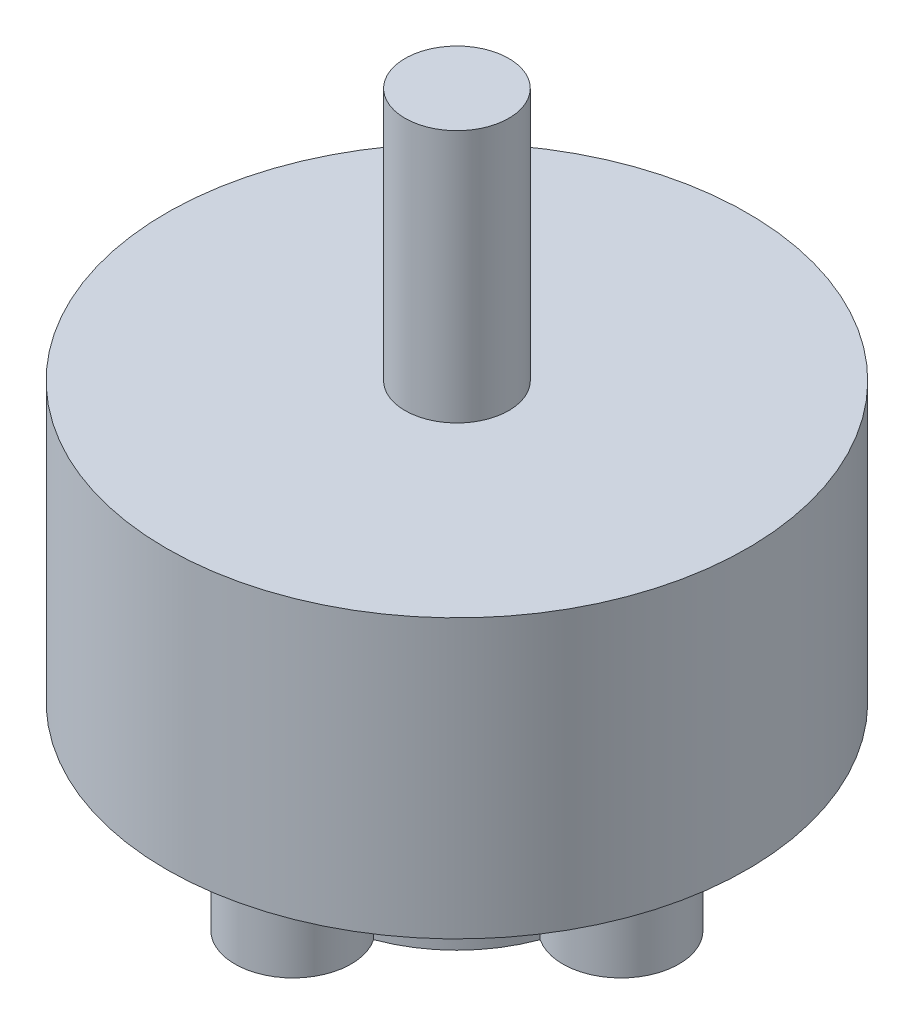
ISO-10303-21;
HEADER;
FILE_DESCRIPTION(('STEP AP214'),'2;1');
FILE_NAME('part.step','',(''),(''),'','','');
FILE_SCHEMA(('AUTOMOTIVE_DESIGN { 1 0 10303 214 1 1 1 1 }'));
ENDSEC;
DATA;
#1=APPLICATION_CONTEXT('core data for automotive mechanical design processes');
#2=APPLICATION_PROTOCOL_DEFINITION('international standard','automotive_design',2000,#1);
#3=PRODUCT_CONTEXT('',#1,'mechanical');
#4=PRODUCT('Part','Part','',(#3));
#5=PRODUCT_RELATED_PRODUCT_CATEGORY('part','',(#4));
#6=PRODUCT_DEFINITION_FORMATION('','',#4);
#7=PRODUCT_DEFINITION_CONTEXT('part definition',#1,'design');
#8=PRODUCT_DEFINITION('design','',#6,#7);
#9=PRODUCT_DEFINITION_SHAPE('','',#8);
#10=(LENGTH_UNIT() NAMED_UNIT(*) SI_UNIT(.MILLI.,.METRE.));
#11=(NAMED_UNIT(*) PLANE_ANGLE_UNIT() SI_UNIT($,.RADIAN.));
#12=(NAMED_UNIT(*) SI_UNIT($,.STERADIAN.) SOLID_ANGLE_UNIT());
#13=UNCERTAINTY_MEASURE_WITH_UNIT(LENGTH_MEASURE(1.E-05),#10,'distance_accuracy_value','');
#14=(GEOMETRIC_REPRESENTATION_CONTEXT(3) GLOBAL_UNCERTAINTY_ASSIGNED_CONTEXT((#13)) GLOBAL_UNIT_ASSIGNED_CONTEXT((#10,
#11,#12)) REPRESENTATION_CONTEXT('',''));
#15=CARTESIAN_POINT('',(0.,0.,0.));
#16=DIRECTION('',(0.,0.,1.));
#17=DIRECTION('',(1.,0.,0.));
#18=AXIS2_PLACEMENT_3D('',#15,#16,#17);
#19=CARTESIAN_POINT('',(0.,0.,0.));
#20=DIRECTION('',(0.,1.,0.));
#21=DIRECTION('',(0.,0.,1.));
#22=AXIS2_PLACEMENT_3D('',#19,#20,#21);
#23=PLANE('',#22);
#24=CARTESIAN_POINT('',(0.,0.,-7.9));
#25=DIRECTION('',(0.,-1.,0.));
#26=DIRECTION('',(0.,0.,-1.));
#27=AXIS2_PLACEMENT_3D('',#24,#25,#26);
#28=CIRCLE('',#27,2.8);
#29=CARTESIAN_POINT('',(-2.323487411199,0.,-6.33749999999998));
#30=VERTEX_POINT('',#29);
#31=CARTESIAN_POINT('',(2.32348741119891,0.,-6.33750000000002));
#32=VERTEX_POINT('',#31);
#33=EDGE_CURVE('E62',#30,#32,#28,.T.);
#34=ORIENTED_EDGE('',*,*,#33,.F.);
#35=CARTESIAN_POINT('',(0.,0.,0.));
#36=DIRECTION('',(0.,-1.,0.));
#37=DIRECTION('',(0.,0.,-1.));
#38=AXIS2_PLACEMENT_3D('',#35,#36,#37);
#39=CIRCLE('',#38,6.75);
#40=CARTESIAN_POINT('',(-6.33750000000002,0.,-2.32348741119888));
#41=VERTEX_POINT('',#40);
#42=EDGE_CURVE('E66',#41,#30,#39,.T.);
#43=ORIENTED_EDGE('',*,*,#42,.F.);
#44=CARTESIAN_POINT('',(-7.9,0.,0.));
#45=DIRECTION('',(0.,-1.,0.));
#46=DIRECTION('',(0.,0.,-1.));
#47=AXIS2_PLACEMENT_3D('',#44,#45,#46);
#48=CIRCLE('',#47,2.8);
#49=CARTESIAN_POINT('',(-6.33749999999998,0.,2.32348741119902));
#50=VERTEX_POINT('',#49);
#51=EDGE_CURVE('E304',#50,#41,#48,.T.);
#52=ORIENTED_EDGE('',*,*,#51,.F.);
#53=CARTESIAN_POINT('',(-2.32348741119895,0.,6.3375));
#54=VERTEX_POINT('',#53);
#55=EDGE_CURVE('E299',#54,#50,#39,.T.);
#56=ORIENTED_EDGE('',*,*,#55,.F.);
#57=CARTESIAN_POINT('',(0.,0.,7.9));
#58=DIRECTION('',(0.,-1.,0.));
#59=DIRECTION('',(0.,0.,-1.));
#60=AXIS2_PLACEMENT_3D('',#57,#58,#59);
#61=CIRCLE('',#60,2.8);
#62=CARTESIAN_POINT('',(2.32348741119895,0.,6.3375));
#63=VERTEX_POINT('',#62);
#64=EDGE_CURVE('E298',#63,#54,#61,.T.);
#65=ORIENTED_EDGE('',*,*,#64,.F.);
#66=CARTESIAN_POINT('',(6.33750000000001,0.,2.32348741119893));
#67=VERTEX_POINT('',#66);
#68=EDGE_CURVE('E291',#67,#63,#39,.T.);
#69=ORIENTED_EDGE('',*,*,#68,.F.);
#70=CARTESIAN_POINT('',(7.9,0.,0.));
#71=DIRECTION('',(0.,-1.,0.));
#72=DIRECTION('',(0.,0.,-1.));
#73=AXIS2_PLACEMENT_3D('',#70,#71,#72);
#74=CIRCLE('',#73,2.8);
#75=CARTESIAN_POINT('',(6.33749999999999,0.,-2.32348741119897));
#76=VERTEX_POINT('',#75);
#77=EDGE_CURVE('E295',#76,#67,#74,.T.);
#78=ORIENTED_EDGE('',*,*,#77,.F.);
#79=EDGE_CURVE('E296',#32,#76,#39,.T.);
#80=ORIENTED_EDGE('',*,*,#79,.F.);
#81=EDGE_LOOP('',(#34,#43,#52,#56,#65,#69,#78,#80));
#82=FACE_BOUND('',#81,.T.);
#83=CARTESIAN_POINT('',(0.,0.,0.));
#84=DIRECTION('',(0.,1.,0.));
#85=DIRECTION('',(0.,0.,1.));
#86=AXIS2_PLACEMENT_3D('',#83,#84,#85);
#87=CIRCLE('',#86,14.);
#88=CARTESIAN_POINT('',(0.,0.,14.));
#89=VERTEX_POINT('',#88);
#90=EDGE_CURVE('E49',#89,#89,#87,.T.);
#91=ORIENTED_EDGE('',*,*,#90,.F.);
#92=EDGE_LOOP('',(#91));
#93=FACE_BOUND('',#92,.T.);
#94=ADVANCED_FACE('F45',(#82,#93),#23,.F.);
#95=CARTESIAN_POINT('',(0.,13.4,0.));
#96=DIRECTION('',(0.,-1.,0.));
#97=DIRECTION('',(0.,0.,-1.));
#98=AXIS2_PLACEMENT_3D('',#95,#96,#97);
#99=CYLINDRICAL_SURFACE('',#98,14.);
#100=CARTESIAN_POINT('',(0.,13.4,0.));
#101=DIRECTION('',(0.,1.,0.));
#102=DIRECTION('',(0.,0.,1.));
#103=AXIS2_PLACEMENT_3D('',#100,#101,#102);
#104=CIRCLE('',#103,14.);
#105=CARTESIAN_POINT('',(0.,13.4,14.));
#106=VERTEX_POINT('',#105);
#107=EDGE_CURVE('E54',#106,#106,#104,.T.);
#108=ORIENTED_EDGE('',*,*,#107,.F.);
#109=EDGE_LOOP('',(#108));
#110=FACE_BOUND('',#109,.T.);
#111=ORIENTED_EDGE('',*,*,#90,.T.);
#112=EDGE_LOOP('',(#111));
#113=FACE_BOUND('',#112,.T.);
#114=ADVANCED_FACE('F47',(#110,#113),#99,.T.);
#115=CARTESIAN_POINT('',(0.,13.4,0.));
#116=DIRECTION('',(0.,1.,0.));
#117=DIRECTION('',(0.,0.,1.));
#118=AXIS2_PLACEMENT_3D('',#115,#116,#117);
#119=PLANE('',#118);
#120=CARTESIAN_POINT('',(0.,13.4,0.));
#121=DIRECTION('',(0.,1.,0.));
#122=DIRECTION('',(0.,0.,1.));
#123=AXIS2_PLACEMENT_3D('',#120,#121,#122);
#124=CIRCLE('',#123,2.5);
#125=CARTESIAN_POINT('',(0.,13.4,2.5));
#126=VERTEX_POINT('',#125);
#127=EDGE_CURVE('E11',#126,#126,#124,.T.);
#128=ORIENTED_EDGE('',*,*,#127,.F.);
#129=EDGE_LOOP('',(#128));
#130=FACE_BOUND('',#129,.T.);
#131=ORIENTED_EDGE('',*,*,#107,.T.);
#132=EDGE_LOOP('',(#131));
#133=FACE_BOUND('',#132,.T.);
#134=ADVANCED_FACE('F211',(#130,#133),#119,.T.);
#135=CARTESIAN_POINT('',(0.,25.6,0.));
#136=DIRECTION('',(0.,-1.,0.));
#137=DIRECTION('',(0.,0.,-1.));
#138=AXIS2_PLACEMENT_3D('',#135,#136,#137);
#139=CYLINDRICAL_SURFACE('',#138,2.5);
#140=CARTESIAN_POINT('',(0.,25.6,0.));
#141=DIRECTION('',(0.,1.,0.));
#142=DIRECTION('',(0.,0.,1.));
#143=AXIS2_PLACEMENT_3D('',#140,#141,#142);
#144=CIRCLE('',#143,2.5);
#145=CARTESIAN_POINT('',(0.,25.6,2.5));
#146=VERTEX_POINT('',#145);
#147=EDGE_CURVE('E193',#146,#146,#144,.T.);
#148=ORIENTED_EDGE('',*,*,#147,.F.);
#149=EDGE_LOOP('',(#148));
#150=FACE_BOUND('',#149,.T.);
#151=ORIENTED_EDGE('',*,*,#127,.T.);
#152=EDGE_LOOP('',(#151));
#153=FACE_BOUND('',#152,.T.);
#154=ADVANCED_FACE('F365',(#150,#153),#139,.T.);
#155=CARTESIAN_POINT('',(0.,25.6,0.));
#156=DIRECTION('',(0.,1.,0.));
#157=DIRECTION('',(0.,0.,1.));
#158=AXIS2_PLACEMENT_3D('',#155,#156,#157);
#159=PLANE('',#158);
#160=ORIENTED_EDGE('',*,*,#147,.T.);
#161=EDGE_LOOP('',(#160));
#162=FACE_BOUND('',#161,.T.);
#163=ADVANCED_FACE('F362',(#162),#159,.T.);
#164=CARTESIAN_POINT('',(0.,-5.6,0.));
#165=DIRECTION('',(0.,1.,0.));
#166=DIRECTION('',(0.,0.,1.));
#167=AXIS2_PLACEMENT_3D('',#164,#165,#166);
#168=CYLINDRICAL_SURFACE('',#167,6.75);
#169=CARTESIAN_POINT('',(-0.452584311355153,0.,-6.73481012658228));
#170=VERTEX_POINT('',#169);
#171=CARTESIAN_POINT('',(0.452584311355059,0.,-6.73481012658228));
#172=VERTEX_POINT('',#171);
#173=EDGE_CURVE('E235',#170,#172,#39,.T.);
#174=ORIENTED_EDGE('',*,*,#173,.T.);
#175=DIRECTION('',(0.,1.,0.));
#176=VECTOR('',#175,1.);
#177=CARTESIAN_POINT('',(0.452584311355059,-5.6,-6.73481012658228));
#178=LINE('',#177,#176);
#179=CARTESIAN_POINT('',(0.452584311355059,-5.6,-6.73481012658228));
#180=VERTEX_POINT('',#179);
#181=EDGE_CURVE('E195',#180,#172,#178,.T.);
#182=ORIENTED_EDGE('',*,*,#181,.F.);
#183=CARTESIAN_POINT('',(0.,-5.6,0.));
#184=DIRECTION('',(0.,-1.,0.));
#185=DIRECTION('',(0.,0.,-1.));
#186=AXIS2_PLACEMENT_3D('',#183,#184,#185);
#187=CIRCLE('',#186,6.75);
#188=CARTESIAN_POINT('',(-0.452584311355153,-5.6,-6.73481012658228));
#189=VERTEX_POINT('',#188);
#190=EDGE_CURVE('E171',#189,#180,#187,.T.);
#191=ORIENTED_EDGE('',*,*,#190,.F.);
#192=DIRECTION('',(0.,1.,0.));
#193=VECTOR('',#192,1.);
#194=CARTESIAN_POINT('',(-0.452584311355153,-5.6,-6.73481012658228));
#195=LINE('',#194,#193);
#196=EDGE_CURVE('E245',#189,#170,#195,.T.);
#197=ORIENTED_EDGE('',*,*,#196,.T.);
#198=EDGE_LOOP('',(#174,#182,#191,#197));
#199=FACE_BOUND('',#198,.T.);
#200=ADVANCED_FACE('F364',(#199),#168,.T.);
#201=CARTESIAN_POINT('',(-7.9,-5.6,0.));
#202=DIRECTION('',(0.,1.,0.));
#203=DIRECTION('',(0.,0.,1.));
#204=AXIS2_PLACEMENT_3D('',#201,#202,#203);
#205=CYLINDRICAL_SURFACE('',#204,1.25);
#206=CARTESIAN_POINT('',(-7.9,0.,0.));
#207=DIRECTION('',(0.,-1.,0.));
#208=DIRECTION('',(0.,0.,-1.));
#209=AXIS2_PLACEMENT_3D('',#206,#207,#208);
#210=CIRCLE('',#209,1.25);
#211=CARTESIAN_POINT('',(-6.73481012658227,0.,0.452584311355193));
#212=VERTEX_POINT('',#211);
#213=CARTESIAN_POINT('',(-6.73481012658228,0.,-0.452584311355049));
#214=VERTEX_POINT('',#213);
#215=EDGE_CURVE('E231',#212,#214,#210,.T.);
#216=ORIENTED_EDGE('',*,*,#215,.F.);
#217=DIRECTION('',(0.,1.,0.));
#218=VECTOR('',#217,1.);
#219=CARTESIAN_POINT('',(-6.73481012658227,-5.6,0.452584311355193));
#220=LINE('',#219,#218);
#221=CARTESIAN_POINT('',(-6.73481012658227,-5.6,0.452584311355193));
#222=VERTEX_POINT('',#221);
#223=EDGE_CURVE('E239',#222,#212,#220,.T.);
#224=ORIENTED_EDGE('',*,*,#223,.F.);
#225=CARTESIAN_POINT('',(-7.9,-5.6,0.));
#226=DIRECTION('',(0.,-1.,0.));
#227=DIRECTION('',(0.,0.,-1.));
#228=AXIS2_PLACEMENT_3D('',#225,#226,#227);
#229=CIRCLE('',#228,1.25);
#230=CARTESIAN_POINT('',(-6.73481012658228,-5.6,-0.452584311355049));
#231=VERTEX_POINT('',#230);
#232=EDGE_CURVE('E335',#222,#231,#229,.T.);
#233=ORIENTED_EDGE('',*,*,#232,.T.);
#234=DIRECTION('',(0.,1.,0.));
#235=VECTOR('',#234,1.);
#236=CARTESIAN_POINT('',(-6.73481012658228,-5.6,-0.452584311355049));
#237=LINE('',#236,#235);
#238=EDGE_CURVE('E246',#231,#214,#237,.T.);
#239=ORIENTED_EDGE('',*,*,#238,.T.);
#240=EDGE_LOOP('',(#216,#224,#233,#239));
#241=FACE_BOUND('',#240,.T.);
#242=ADVANCED_FACE('F248',(#241),#205,.F.);
#243=CARTESIAN_POINT('',(0.,-5.6,7.9));
#244=DIRECTION('',(0.,1.,0.));
#245=DIRECTION('',(0.,0.,1.));
#246=AXIS2_PLACEMENT_3D('',#243,#244,#245);
#247=CYLINDRICAL_SURFACE('',#246,1.25);
#248=CARTESIAN_POINT('',(0.,0.,7.9));
#249=DIRECTION('',(0.,-1.,0.));
#250=DIRECTION('',(0.,0.,-1.));
#251=AXIS2_PLACEMENT_3D('',#248,#249,#250);
#252=CIRCLE('',#251,1.25);
#253=CARTESIAN_POINT('',(0.452584311355121,0.,6.73481012658228));
#254=VERTEX_POINT('',#253);
#255=CARTESIAN_POINT('',(-0.452584311355121,0.,6.73481012658228));
#256=VERTEX_POINT('',#255);
#257=EDGE_CURVE('E251',#254,#256,#252,.T.);
#258=ORIENTED_EDGE('',*,*,#257,.F.);
#259=DIRECTION('',(0.,1.,0.));
#260=VECTOR('',#259,1.);
#261=CARTESIAN_POINT('',(0.452584311355121,-5.6,6.73481012658228));
#262=LINE('',#261,#260);
#263=CARTESIAN_POINT('',(0.452584311355121,-5.6,6.73481012658228));
#264=VERTEX_POINT('',#263);
#265=EDGE_CURVE('E261',#264,#254,#262,.T.);
#266=ORIENTED_EDGE('',*,*,#265,.F.);
#267=CARTESIAN_POINT('',(0.,-5.6,7.9));
#268=DIRECTION('',(0.,-1.,0.));
#269=DIRECTION('',(0.,0.,-1.));
#270=AXIS2_PLACEMENT_3D('',#267,#268,#269);
#271=CIRCLE('',#270,1.25);
#272=CARTESIAN_POINT('',(-0.452584311355121,-5.6,6.73481012658228));
#273=VERTEX_POINT('',#272);
#274=EDGE_CURVE('E331',#264,#273,#271,.T.);
#275=ORIENTED_EDGE('',*,*,#274,.T.);
#276=DIRECTION('',(0.,1.,0.));
#277=VECTOR('',#276,1.);
#278=CARTESIAN_POINT('',(-0.452584311355121,-5.6,6.73481012658228));
#279=LINE('',#278,#277);
#280=EDGE_CURVE('E263',#273,#256,#279,.T.);
#281=ORIENTED_EDGE('',*,*,#280,.T.);
#282=EDGE_LOOP('',(#258,#266,#275,#281));
#283=FACE_BOUND('',#282,.T.);
#284=ADVANCED_FACE('F426',(#283),#247,.F.);
#285=CARTESIAN_POINT('',(7.9,-5.6,0.));
#286=DIRECTION('',(0.,1.,0.));
#287=DIRECTION('',(0.,0.,1.));
#288=AXIS2_PLACEMENT_3D('',#285,#286,#287);
#289=CYLINDRICAL_SURFACE('',#288,1.25);
#290=CARTESIAN_POINT('',(7.9,0.,0.));
#291=DIRECTION('',(0.,-1.,0.));
#292=DIRECTION('',(0.,0.,-1.));
#293=AXIS2_PLACEMENT_3D('',#290,#291,#292);
#294=CIRCLE('',#293,1.25);
#295=CARTESIAN_POINT('',(6.73481012658228,0.,-0.452584311355144));
#296=VERTEX_POINT('',#295);
#297=CARTESIAN_POINT('',(6.73481012658228,0.,0.452584311355099));
#298=VERTEX_POINT('',#297);
#299=EDGE_CURVE('E305',#296,#298,#294,.T.);
#300=ORIENTED_EDGE('',*,*,#299,.F.);
#301=DIRECTION('',(0.,1.,0.));
#302=VECTOR('',#301,1.);
#303=CARTESIAN_POINT('',(6.73481012658228,-5.6,-0.452584311355144));
#304=LINE('',#303,#302);
#305=CARTESIAN_POINT('',(6.73481012658228,-5.6,-0.452584311355144));
#306=VERTEX_POINT('',#305);
#307=EDGE_CURVE('E187',#306,#296,#304,.T.);
#308=ORIENTED_EDGE('',*,*,#307,.F.);
#309=CARTESIAN_POINT('',(7.9,-5.6,0.));
#310=DIRECTION('',(0.,-1.,0.));
#311=DIRECTION('',(0.,0.,-1.));
#312=AXIS2_PLACEMENT_3D('',#309,#310,#311);
#313=CIRCLE('',#312,1.25);
#314=CARTESIAN_POINT('',(6.73481012658228,-5.6,0.452584311355099));
#315=VERTEX_POINT('',#314);
#316=EDGE_CURVE('E323',#306,#315,#313,.T.);
#317=ORIENTED_EDGE('',*,*,#316,.T.);
#318=DIRECTION('',(0.,1.,0.));
#319=VECTOR('',#318,1.);
#320=CARTESIAN_POINT('',(6.73481012658228,-5.6,0.452584311355099));
#321=LINE('',#320,#319);
#322=EDGE_CURVE('E184',#315,#298,#321,.T.);
#323=ORIENTED_EDGE('',*,*,#322,.T.);
#324=EDGE_LOOP('',(#300,#308,#317,#323));
#325=FACE_BOUND('',#324,.T.);
#326=ADVANCED_FACE('F361',(#325),#289,.F.);
#327=CARTESIAN_POINT('',(0.,-5.6,-7.9));
#328=DIRECTION('',(0.,1.,0.));
#329=DIRECTION('',(0.,0.,1.));
#330=AXIS2_PLACEMENT_3D('',#327,#328,#329);
#331=CYLINDRICAL_SURFACE('',#330,2.8);
#332=ORIENTED_EDGE('',*,*,#33,.T.);
#333=DIRECTION('',(0.,1.,0.));
#334=VECTOR('',#333,1.);
#335=CARTESIAN_POINT('',(2.32348741119891,-5.6,-6.33750000000002));
#336=LINE('',#335,#334);
#337=CARTESIAN_POINT('',(2.32348741119891,-5.6,-6.33750000000002));
#338=VERTEX_POINT('',#337);
#339=EDGE_CURVE('E163',#338,#32,#336,.T.);
#340=ORIENTED_EDGE('',*,*,#339,.F.);
#341=CARTESIAN_POINT('',(0.,-5.6,-7.9));
#342=DIRECTION('',(0.,-1.,0.));
#343=DIRECTION('',(0.,0.,-1.));
#344=AXIS2_PLACEMENT_3D('',#341,#342,#343);
#345=CIRCLE('',#344,2.8);
#346=CARTESIAN_POINT('',(-2.323487411199,-5.6,-6.33749999999998));
#347=VERTEX_POINT('',#346);
#348=EDGE_CURVE('E169',#347,#338,#345,.T.);
#349=ORIENTED_EDGE('',*,*,#348,.F.);
#350=DIRECTION('',(0.,1.,0.));
#351=VECTOR('',#350,1.);
#352=CARTESIAN_POINT('',(-2.323487411199,-5.6,-6.33749999999998));
#353=LINE('',#352,#351);
#354=EDGE_CURVE('E270',#347,#30,#353,.T.);
#355=ORIENTED_EDGE('',*,*,#354,.T.);
#356=EDGE_LOOP('',(#332,#340,#349,#355));
#357=FACE_BOUND('',#356,.T.);
#358=ADVANCED_FACE('F183',(#357),#331,.T.);
#359=ORIENTED_EDGE('',*,*,#79,.T.);
#360=DIRECTION('',(0.,1.,0.));
#361=VECTOR('',#360,1.);
#362=CARTESIAN_POINT('',(6.33749999999999,-5.6,-2.32348741119897));
#363=LINE('',#362,#361);
#364=CARTESIAN_POINT('',(6.33749999999999,-5.6,-2.32348741119897));
#365=VERTEX_POINT('',#364);
#366=EDGE_CURVE('E165',#365,#76,#363,.T.);
#367=ORIENTED_EDGE('',*,*,#366,.F.);
#368=EDGE_CURVE('E158',#338,#365,#187,.T.);
#369=ORIENTED_EDGE('',*,*,#368,.F.);
#370=ORIENTED_EDGE('',*,*,#339,.T.);
#371=EDGE_LOOP('',(#359,#367,#369,#370));
#372=FACE_BOUND('',#371,.T.);
#373=ADVANCED_FACE('F161',(#372),#168,.T.);
#374=CARTESIAN_POINT('',(7.9,-5.6,0.));
#375=DIRECTION('',(0.,1.,0.));
#376=DIRECTION('',(0.,0.,1.));
#377=AXIS2_PLACEMENT_3D('',#374,#375,#376);
#378=CYLINDRICAL_SURFACE('',#377,2.8);
#379=ORIENTED_EDGE('',*,*,#77,.T.);
#380=DIRECTION('',(0.,1.,0.));
#381=VECTOR('',#380,1.);
#382=CARTESIAN_POINT('',(6.33750000000001,-5.6,2.32348741119893));
#383=LINE('',#382,#381);
#384=CARTESIAN_POINT('',(6.33750000000001,-5.6,2.32348741119893));
#385=VERTEX_POINT('',#384);
#386=EDGE_CURVE('E189',#385,#67,#383,.T.);
#387=ORIENTED_EDGE('',*,*,#386,.F.);
#388=CARTESIAN_POINT('',(7.9,-5.6,0.));
#389=DIRECTION('',(0.,-1.,0.));
#390=DIRECTION('',(0.,0.,-1.));
#391=AXIS2_PLACEMENT_3D('',#388,#389,#390);
#392=CIRCLE('',#391,2.8);
#393=EDGE_CURVE('E168',#365,#385,#392,.T.);
#394=ORIENTED_EDGE('',*,*,#393,.F.);
#395=ORIENTED_EDGE('',*,*,#366,.T.);
#396=EDGE_LOOP('',(#379,#387,#394,#395));
#397=FACE_BOUND('',#396,.T.);
#398=ADVANCED_FACE('F294',(#397),#378,.T.);
#399=ORIENTED_EDGE('',*,*,#68,.T.);
#400=DIRECTION('',(0.,1.,0.));
#401=VECTOR('',#400,1.);
#402=CARTESIAN_POINT('',(2.32348741119895,-5.6,6.3375));
#403=LINE('',#402,#401);
#404=CARTESIAN_POINT('',(2.32348741119895,-5.6,6.3375));
#405=VERTEX_POINT('',#404);
#406=EDGE_CURVE('E282',#405,#63,#403,.T.);
#407=ORIENTED_EDGE('',*,*,#406,.F.);
#408=EDGE_CURVE('E172',#385,#405,#187,.T.);
#409=ORIENTED_EDGE('',*,*,#408,.F.);
#410=ORIENTED_EDGE('',*,*,#386,.T.);
#411=EDGE_LOOP('',(#399,#407,#409,#410));
#412=FACE_BOUND('',#411,.T.);
#413=ADVANCED_FACE('F289',(#412),#168,.T.);
#414=CARTESIAN_POINT('',(0.,-5.6,7.9));
#415=DIRECTION('',(0.,1.,0.));
#416=DIRECTION('',(0.,0.,1.));
#417=AXIS2_PLACEMENT_3D('',#414,#415,#416);
#418=CYLINDRICAL_SURFACE('',#417,2.8);
#419=ORIENTED_EDGE('',*,*,#64,.T.);
#420=DIRECTION('',(0.,1.,0.));
#421=VECTOR('',#420,1.);
#422=CARTESIAN_POINT('',(-2.32348741119895,-5.6,6.3375));
#423=LINE('',#422,#421);
#424=CARTESIAN_POINT('',(-2.32348741119895,-5.6,6.3375));
#425=VERTEX_POINT('',#424);
#426=EDGE_CURVE('E279',#425,#54,#423,.T.);
#427=ORIENTED_EDGE('',*,*,#426,.F.);
#428=CARTESIAN_POINT('',(0.,-5.6,7.9));
#429=DIRECTION('',(0.,-1.,0.));
#430=DIRECTION('',(0.,0.,-1.));
#431=AXIS2_PLACEMENT_3D('',#428,#429,#430);
#432=CIRCLE('',#431,2.8);
#433=EDGE_CURVE('E325',#405,#425,#432,.T.);
#434=ORIENTED_EDGE('',*,*,#433,.F.);
#435=ORIENTED_EDGE('',*,*,#406,.T.);
#436=EDGE_LOOP('',(#419,#427,#434,#435));
#437=FACE_BOUND('',#436,.T.);
#438=ADVANCED_FACE('F345',(#437),#418,.T.);
#439=ORIENTED_EDGE('',*,*,#55,.T.);
#440=DIRECTION('',(0.,1.,0.));
#441=VECTOR('',#440,1.);
#442=CARTESIAN_POINT('',(-6.33749999999998,-5.6,2.32348741119902));
#443=LINE('',#442,#441);
#444=CARTESIAN_POINT('',(-6.33749999999998,-5.6,2.32348741119902));
#445=VERTEX_POINT('',#444);
#446=EDGE_CURVE('E276',#445,#50,#443,.T.);
#447=ORIENTED_EDGE('',*,*,#446,.F.);
#448=EDGE_CURVE('E321',#425,#445,#187,.T.);
#449=ORIENTED_EDGE('',*,*,#448,.F.);
#450=ORIENTED_EDGE('',*,*,#426,.T.);
#451=EDGE_LOOP('',(#439,#447,#449,#450));
#452=FACE_BOUND('',#451,.T.);
#453=ADVANCED_FACE('F313',(#452),#168,.T.);
#454=CARTESIAN_POINT('',(-7.9,-5.6,0.));
#455=DIRECTION('',(0.,1.,0.));
#456=DIRECTION('',(0.,0.,1.));
#457=AXIS2_PLACEMENT_3D('',#454,#455,#456);
#458=CYLINDRICAL_SURFACE('',#457,2.8);
#459=ORIENTED_EDGE('',*,*,#51,.T.);
#460=DIRECTION('',(0.,1.,0.));
#461=VECTOR('',#460,1.);
#462=CARTESIAN_POINT('',(-6.33750000000002,-5.6,-2.32348741119888));
#463=LINE('',#462,#461);
#464=CARTESIAN_POINT('',(-6.33750000000002,-5.6,-2.32348741119888));
#465=VERTEX_POINT('',#464);
#466=EDGE_CURVE('E272',#465,#41,#463,.T.);
#467=ORIENTED_EDGE('',*,*,#466,.F.);
#468=CARTESIAN_POINT('',(-7.9,-5.6,0.));
#469=DIRECTION('',(0.,-1.,0.));
#470=DIRECTION('',(0.,0.,-1.));
#471=AXIS2_PLACEMENT_3D('',#468,#469,#470);
#472=CIRCLE('',#471,2.8);
#473=EDGE_CURVE('E320',#445,#465,#472,.T.);
#474=ORIENTED_EDGE('',*,*,#473,.F.);
#475=ORIENTED_EDGE('',*,*,#446,.T.);
#476=EDGE_LOOP('',(#459,#467,#474,#475));
#477=FACE_BOUND('',#476,.T.);
#478=ADVANCED_FACE('F318',(#477),#458,.T.);
#479=EDGE_CURVE('E228',#212,#214,#39,.T.);
#480=ORIENTED_EDGE('',*,*,#479,.T.);
#481=ORIENTED_EDGE('',*,*,#238,.F.);
#482=EDGE_CURVE('E241',#222,#231,#187,.T.);
#483=ORIENTED_EDGE('',*,*,#482,.F.);
#484=ORIENTED_EDGE('',*,*,#223,.T.);
#485=EDGE_LOOP('',(#480,#481,#483,#484));
#486=FACE_BOUND('',#485,.T.);
#487=ADVANCED_FACE('F240',(#486),#168,.T.);
#488=EDGE_CURVE('E237',#254,#256,#39,.T.);
#489=ORIENTED_EDGE('',*,*,#488,.T.);
#490=ORIENTED_EDGE('',*,*,#280,.F.);
#491=EDGE_CURVE('E334',#264,#273,#187,.T.);
#492=ORIENTED_EDGE('',*,*,#491,.F.);
#493=ORIENTED_EDGE('',*,*,#265,.T.);
#494=EDGE_LOOP('',(#489,#490,#492,#493));
#495=FACE_BOUND('',#494,.T.);
#496=ADVANCED_FACE('F494',(#495),#168,.T.);
#497=EDGE_CURVE('E252',#296,#298,#39,.T.);
#498=ORIENTED_EDGE('',*,*,#497,.T.);
#499=ORIENTED_EDGE('',*,*,#322,.F.);
#500=EDGE_CURVE('E324',#306,#315,#187,.T.);
#501=ORIENTED_EDGE('',*,*,#500,.F.);
#502=ORIENTED_EDGE('',*,*,#307,.T.);
#503=EDGE_LOOP('',(#498,#499,#501,#502));
#504=FACE_BOUND('',#503,.T.);
#505=ADVANCED_FACE('F502',(#504),#168,.T.);
#506=ORIENTED_EDGE('',*,*,#42,.T.);
#507=ORIENTED_EDGE('',*,*,#354,.F.);
#508=EDGE_CURVE('E177',#465,#347,#187,.T.);
#509=ORIENTED_EDGE('',*,*,#508,.F.);
#510=ORIENTED_EDGE('',*,*,#466,.T.);
#511=EDGE_LOOP('',(#506,#507,#509,#510));
#512=FACE_BOUND('',#511,.T.);
#513=ADVANCED_FACE('F353',(#512),#168,.T.);
#514=CARTESIAN_POINT('',(0.,-5.6,-7.9));
#515=DIRECTION('',(0.,1.,0.));
#516=DIRECTION('',(0.,0.,1.));
#517=AXIS2_PLACEMENT_3D('',#514,#515,#516);
#518=CYLINDRICAL_SURFACE('',#517,1.25);
#519=CARTESIAN_POINT('',(0.,0.,-7.9));
#520=DIRECTION('',(0.,-1.,0.));
#521=DIRECTION('',(0.,0.,-1.));
#522=AXIS2_PLACEMENT_3D('',#519,#520,#521);
#523=CIRCLE('',#522,1.25);
#524=EDGE_CURVE('E181',#170,#172,#523,.T.);
#525=ORIENTED_EDGE('',*,*,#524,.F.);
#526=ORIENTED_EDGE('',*,*,#196,.F.);
#527=CARTESIAN_POINT('',(0.,-5.6,-7.9));
#528=DIRECTION('',(0.,-1.,0.));
#529=DIRECTION('',(0.,0.,-1.));
#530=AXIS2_PLACEMENT_3D('',#527,#528,#529);
#531=CIRCLE('',#530,1.25);
#532=EDGE_CURVE('E273',#189,#180,#531,.T.);
#533=ORIENTED_EDGE('',*,*,#532,.T.);
#534=ORIENTED_EDGE('',*,*,#181,.T.);
#535=EDGE_LOOP('',(#525,#526,#533,#534));
#536=FACE_BOUND('',#535,.T.);
#537=ADVANCED_FACE('F225',(#536),#518,.F.);
#538=CARTESIAN_POINT('',(0.,-5.6,0.));
#539=DIRECTION('',(0.,-1.,0.));
#540=DIRECTION('',(0.,0.,-1.));
#541=AXIS2_PLACEMENT_3D('',#538,#539,#540);
#542=PLANE('',#541);
#543=ORIENTED_EDGE('',*,*,#348,.T.);
#544=ORIENTED_EDGE('',*,*,#368,.T.);
#545=ORIENTED_EDGE('',*,*,#393,.T.);
#546=ORIENTED_EDGE('',*,*,#408,.T.);
#547=ORIENTED_EDGE('',*,*,#433,.T.);
#548=ORIENTED_EDGE('',*,*,#448,.T.);
#549=ORIENTED_EDGE('',*,*,#473,.T.);
#550=ORIENTED_EDGE('',*,*,#508,.T.);
#551=EDGE_LOOP('',(#543,#544,#545,#546,#547,#548,#549,#550));
#552=FACE_BOUND('',#551,.T.);
#553=ORIENTED_EDGE('',*,*,#316,.F.);
#554=ORIENTED_EDGE('',*,*,#500,.T.);
#555=EDGE_LOOP('',(#553,#554));
#556=FACE_BOUND('',#555,.T.);
#557=ORIENTED_EDGE('',*,*,#274,.F.);
#558=ORIENTED_EDGE('',*,*,#491,.T.);
#559=EDGE_LOOP('',(#557,#558));
#560=FACE_BOUND('',#559,.T.);
#561=ORIENTED_EDGE('',*,*,#232,.F.);
#562=ORIENTED_EDGE('',*,*,#482,.T.);
#563=EDGE_LOOP('',(#561,#562));
#564=FACE_BOUND('',#563,.T.);
#565=ORIENTED_EDGE('',*,*,#190,.T.);
#566=ORIENTED_EDGE('',*,*,#532,.F.);
#567=EDGE_LOOP('',(#565,#566));
#568=FACE_BOUND('',#567,.T.);
#569=ADVANCED_FACE('F174',(#552,#556,#560,#564,#568),#542,.T.);
#570=ORIENTED_EDGE('',*,*,#479,.F.);
#571=ORIENTED_EDGE('',*,*,#215,.T.);
#572=EDGE_LOOP('',(#570,#571));
#573=FACE_BOUND('',#572,.T.);
#574=ADVANCED_FACE('F205',(#573),#23,.F.);
#575=ORIENTED_EDGE('',*,*,#488,.F.);
#576=ORIENTED_EDGE('',*,*,#257,.T.);
#577=EDGE_LOOP('',(#575,#576));
#578=FACE_BOUND('',#577,.T.);
#579=ADVANCED_FACE('F218',(#578),#23,.F.);
#580=ORIENTED_EDGE('',*,*,#497,.F.);
#581=ORIENTED_EDGE('',*,*,#299,.T.);
#582=EDGE_LOOP('',(#580,#581));
#583=FACE_BOUND('',#582,.T.);
#584=ADVANCED_FACE('F215',(#583),#23,.F.);
#585=ORIENTED_EDGE('',*,*,#173,.F.);
#586=ORIENTED_EDGE('',*,*,#524,.T.);
#587=EDGE_LOOP('',(#585,#586));
#588=FACE_BOUND('',#587,.T.);
#589=ADVANCED_FACE('F204',(#588),#23,.F.);
#590=CLOSED_SHELL('',(#94,#114,#134,#154,#163,#200,#242,#284,#326,#358,#373,#398,#413,#438,#453,
#478,#487,#496,#505,#513,#537,#569,#574,#579,#584,#589));
#591=MANIFOLD_SOLID_BREP('B2',#590);
#592=ADVANCED_BREP_SHAPE_REPRESENTATION('',(#18,#591),#14);
#593=SHAPE_DEFINITION_REPRESENTATION(#9,#592);
ENDSEC;
END-ISO-10303-21;
